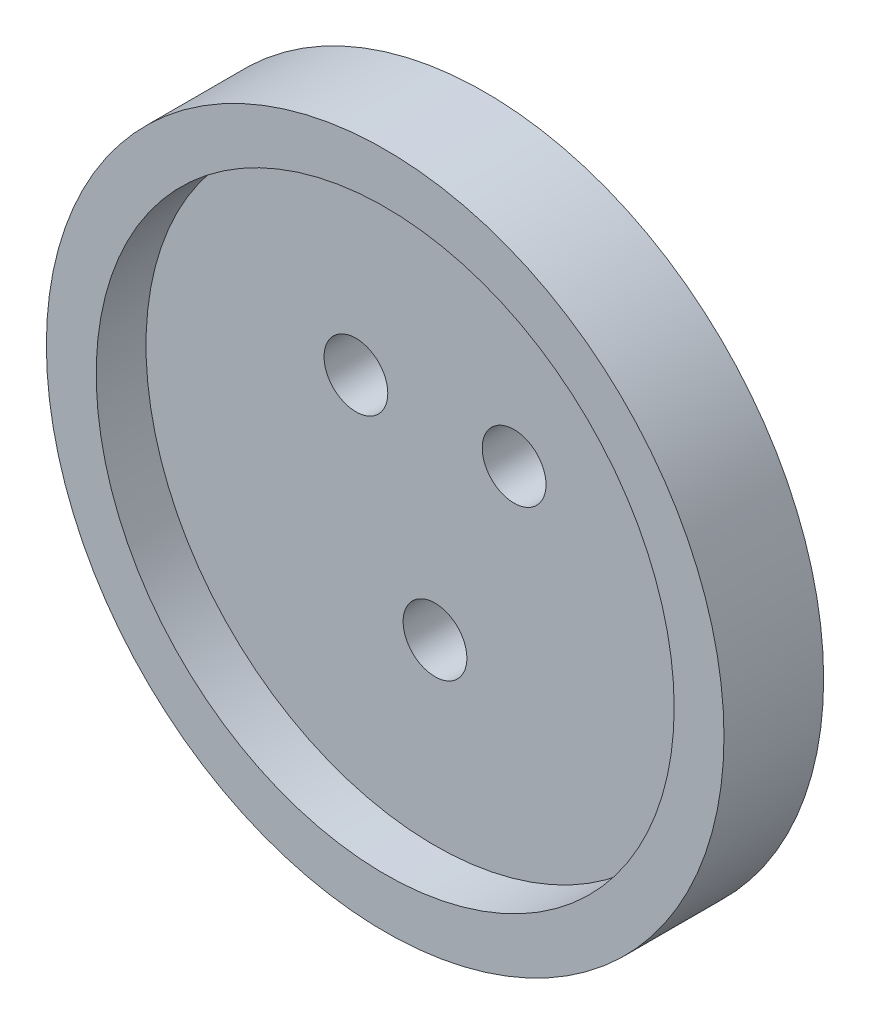
ISO-10303-21;
HEADER;
FILE_DESCRIPTION(('STEP AP214'),'2;1');
FILE_NAME('part.step','',(''),(''),'','','');
FILE_SCHEMA(('AUTOMOTIVE_DESIGN { 1 0 10303 214 1 1 1 1 }'));
ENDSEC;
DATA;
#1=APPLICATION_CONTEXT('core data for automotive mechanical design processes');
#2=APPLICATION_PROTOCOL_DEFINITION('international standard','automotive_design',2000,#1);
#3=PRODUCT_CONTEXT('',#1,'mechanical');
#4=PRODUCT('Part','Part','',(#3));
#5=PRODUCT_RELATED_PRODUCT_CATEGORY('part','',(#4));
#6=PRODUCT_DEFINITION_FORMATION('','',#4);
#7=PRODUCT_DEFINITION_CONTEXT('part definition',#1,'design');
#8=PRODUCT_DEFINITION('design','',#6,#7);
#9=PRODUCT_DEFINITION_SHAPE('','',#8);
#10=(LENGTH_UNIT() NAMED_UNIT(*) SI_UNIT(.MILLI.,.METRE.));
#11=(NAMED_UNIT(*) PLANE_ANGLE_UNIT() SI_UNIT($,.RADIAN.));
#12=(NAMED_UNIT(*) SI_UNIT($,.STERADIAN.) SOLID_ANGLE_UNIT());
#13=UNCERTAINTY_MEASURE_WITH_UNIT(LENGTH_MEASURE(1.E-05),#10,'distance_accuracy_value','');
#14=(GEOMETRIC_REPRESENTATION_CONTEXT(3) GLOBAL_UNCERTAINTY_ASSIGNED_CONTEXT((#13)) GLOBAL_UNIT_ASSIGNED_CONTEXT((#10,
#11,#12)) REPRESENTATION_CONTEXT('',''));
#15=CARTESIAN_POINT('',(0.,0.,0.));
#16=DIRECTION('',(0.,0.,1.));
#17=DIRECTION('',(1.,0.,0.));
#18=AXIS2_PLACEMENT_3D('',#15,#16,#17);
#19=CARTESIAN_POINT('',(0.,0.,0.));
#20=DIRECTION('',(0.,0.,1.));
#21=DIRECTION('',(1.,0.,0.));
#22=AXIS2_PLACEMENT_3D('',#19,#20,#21);
#23=PLANE('',#22);
#24=CARTESIAN_POINT('',(0.,-11.1125,0.));
#25=DIRECTION('',(0.,0.,1.));
#26=DIRECTION('',(1.,0.,0.));
#27=AXIS2_PLACEMENT_3D('',#24,#25,#26);
#28=CIRCLE('',#27,3.2);
#29=CARTESIAN_POINT('',(3.2,-11.1125,0.));
#30=VERTEX_POINT('',#29);
#31=EDGE_CURVE('E49',#30,#30,#28,.T.);
#32=ORIENTED_EDGE('',*,*,#31,.T.);
#33=EDGE_LOOP('',(#32));
#34=FACE_BOUND('',#33,.T.);
#35=CARTESIAN_POINT('',(7.9375,7.9375,0.));
#36=DIRECTION('',(0.,0.,1.));
#37=DIRECTION('',(1.,0.,0.));
#38=AXIS2_PLACEMENT_3D('',#35,#36,#37);
#39=CIRCLE('',#38,3.2);
#40=CARTESIAN_POINT('',(11.1375,7.9375,0.));
#41=VERTEX_POINT('',#40);
#42=EDGE_CURVE('E44',#41,#41,#39,.T.);
#43=ORIENTED_EDGE('',*,*,#42,.T.);
#44=EDGE_LOOP('',(#43));
#45=FACE_BOUND('',#44,.T.);
#46=CARTESIAN_POINT('',(-7.9375,7.9375,0.));
#47=DIRECTION('',(0.,0.,1.));
#48=DIRECTION('',(1.,0.,0.));
#49=AXIS2_PLACEMENT_3D('',#46,#47,#48);
#50=CIRCLE('',#49,3.2);
#51=CARTESIAN_POINT('',(-4.7375,7.9375,0.));
#52=VERTEX_POINT('',#51);
#53=EDGE_CURVE('E35',#52,#52,#50,.T.);
#54=ORIENTED_EDGE('',*,*,#53,.T.);
#55=EDGE_LOOP('',(#54));
#56=FACE_BOUND('',#55,.T.);
#57=CARTESIAN_POINT('',(0.,0.,0.));
#58=DIRECTION('',(0.,0.,-1.));
#59=DIRECTION('',(-1.,0.,0.));
#60=AXIS2_PLACEMENT_3D('',#57,#58,#59);
#61=CIRCLE('',#60,34.);
#62=CARTESIAN_POINT('',(-34.,0.,0.));
#63=VERTEX_POINT('',#62);
#64=EDGE_CURVE('E55',#63,#63,#61,.T.);
#65=ORIENTED_EDGE('',*,*,#64,.T.);
#66=EDGE_LOOP('',(#65));
#67=FACE_BOUND('',#66,.T.);
#68=ADVANCED_FACE('F29',(#34,#45,#56,#67),#23,.F.);
#69=CARTESIAN_POINT('',(0.,0.,5.));
#70=DIRECTION('',(0.,0.,1.));
#71=DIRECTION('',(1.,0.,0.));
#72=AXIS2_PLACEMENT_3D('',#69,#70,#71);
#73=PLANE('',#72);
#74=CARTESIAN_POINT('',(0.,0.,5.));
#75=DIRECTION('',(0.,0.,1.));
#76=DIRECTION('',(1.,0.,0.));
#77=AXIS2_PLACEMENT_3D('',#74,#75,#76);
#78=CIRCLE('',#77,29.);
#79=CARTESIAN_POINT('',(29.,0.,5.));
#80=VERTEX_POINT('',#79);
#81=EDGE_CURVE('E10',#80,#80,#78,.F.);
#82=ORIENTED_EDGE('',*,*,#81,.F.);
#83=EDGE_LOOP('',(#82));
#84=FACE_BOUND('',#83,.T.);
#85=CARTESIAN_POINT('',(0.,-11.1125,5.));
#86=DIRECTION('',(0.,0.,1.));
#87=DIRECTION('',(1.,0.,0.));
#88=AXIS2_PLACEMENT_3D('',#85,#86,#87);
#89=CIRCLE('',#88,3.2);
#90=CARTESIAN_POINT('',(3.2,-11.1125,5.));
#91=VERTEX_POINT('',#90);
#92=EDGE_CURVE('E52',#91,#91,#89,.T.);
#93=ORIENTED_EDGE('',*,*,#92,.F.);
#94=EDGE_LOOP('',(#93));
#95=FACE_BOUND('',#94,.T.);
#96=CARTESIAN_POINT('',(7.9375,7.9375,5.));
#97=DIRECTION('',(0.,0.,1.));
#98=DIRECTION('',(1.,0.,0.));
#99=AXIS2_PLACEMENT_3D('',#96,#97,#98);
#100=CIRCLE('',#99,3.2);
#101=CARTESIAN_POINT('',(11.1375,7.9375,5.));
#102=VERTEX_POINT('',#101);
#103=EDGE_CURVE('E46',#102,#102,#100,.T.);
#104=ORIENTED_EDGE('',*,*,#103,.F.);
#105=EDGE_LOOP('',(#104));
#106=FACE_BOUND('',#105,.T.);
#107=CARTESIAN_POINT('',(-7.9375,7.9375,5.));
#108=DIRECTION('',(0.,0.,1.));
#109=DIRECTION('',(1.,0.,0.));
#110=AXIS2_PLACEMENT_3D('',#107,#108,#109);
#111=CIRCLE('',#110,3.2);
#112=CARTESIAN_POINT('',(-4.7375,7.9375,5.));
#113=VERTEX_POINT('',#112);
#114=EDGE_CURVE('E39',#113,#113,#111,.T.);
#115=ORIENTED_EDGE('',*,*,#114,.F.);
#116=EDGE_LOOP('',(#115));
#117=FACE_BOUND('',#116,.T.);
#118=ADVANCED_FACE('F83',(#84,#95,#106,#117),#73,.T.);
#119=CARTESIAN_POINT('',(-7.9375,7.9375,0.));
#120=DIRECTION('',(0.,0.,1.));
#121=DIRECTION('',(1.,0.,0.));
#122=AXIS2_PLACEMENT_3D('',#119,#120,#121);
#123=CYLINDRICAL_SURFACE('',#122,3.2);
#124=ORIENTED_EDGE('',*,*,#53,.F.);
#125=EDGE_LOOP('',(#124));
#126=FACE_BOUND('',#125,.T.);
#127=ORIENTED_EDGE('',*,*,#114,.T.);
#128=EDGE_LOOP('',(#127));
#129=FACE_BOUND('',#128,.T.);
#130=ADVANCED_FACE('F88',(#126,#129),#123,.F.);
#131=CARTESIAN_POINT('',(7.9375,7.9375,0.));
#132=DIRECTION('',(0.,0.,1.));
#133=DIRECTION('',(1.,0.,0.));
#134=AXIS2_PLACEMENT_3D('',#131,#132,#133);
#135=CYLINDRICAL_SURFACE('',#134,3.2);
#136=ORIENTED_EDGE('',*,*,#42,.F.);
#137=EDGE_LOOP('',(#136));
#138=FACE_BOUND('',#137,.T.);
#139=ORIENTED_EDGE('',*,*,#103,.T.);
#140=EDGE_LOOP('',(#139));
#141=FACE_BOUND('',#140,.T.);
#142=ADVANCED_FACE('F98',(#138,#141),#135,.F.);
#143=CARTESIAN_POINT('',(0.,-11.1125,0.));
#144=DIRECTION('',(0.,0.,1.));
#145=DIRECTION('',(1.,0.,0.));
#146=AXIS2_PLACEMENT_3D('',#143,#144,#145);
#147=CYLINDRICAL_SURFACE('',#146,3.2);
#148=ORIENTED_EDGE('',*,*,#31,.F.);
#149=EDGE_LOOP('',(#148));
#150=FACE_BOUND('',#149,.T.);
#151=ORIENTED_EDGE('',*,*,#92,.T.);
#152=EDGE_LOOP('',(#151));
#153=FACE_BOUND('',#152,.T.);
#154=ADVANCED_FACE('F79',(#150,#153),#147,.F.);
#155=CARTESIAN_POINT('',(0.,0.,5.));
#156=DIRECTION('',(0.,0.,-1.));
#157=DIRECTION('',(-1.,0.,0.));
#158=AXIS2_PLACEMENT_3D('',#155,#156,#157);
#159=CYLINDRICAL_SURFACE('',#158,34.);
#160=ORIENTED_EDGE('',*,*,#64,.F.);
#161=EDGE_LOOP('',(#160));
#162=FACE_BOUND('',#161,.T.);
#163=CARTESIAN_POINT('',(0.,0.,10.));
#164=DIRECTION('',(0.,0.,1.));
#165=DIRECTION('',(1.,0.,0.));
#166=AXIS2_PLACEMENT_3D('',#163,#164,#165);
#167=CIRCLE('',#166,34.);
#168=CARTESIAN_POINT('',(34.,0.,10.));
#169=VERTEX_POINT('',#168);
#170=EDGE_CURVE('E60',#169,#169,#167,.T.);
#171=ORIENTED_EDGE('',*,*,#170,.F.);
#172=EDGE_LOOP('',(#171));
#173=FACE_BOUND('',#172,.T.);
#174=ADVANCED_FACE('F71',(#162,#173),#159,.T.);
#175=CARTESIAN_POINT('',(0.,0.,10.));
#176=DIRECTION('',(0.,0.,1.));
#177=DIRECTION('',(1.,0.,0.));
#178=AXIS2_PLACEMENT_3D('',#175,#176,#177);
#179=PLANE('',#178);
#180=ORIENTED_EDGE('',*,*,#170,.T.);
#181=EDGE_LOOP('',(#180));
#182=FACE_BOUND('',#181,.T.);
#183=CARTESIAN_POINT('',(0.,0.,10.));
#184=DIRECTION('',(0.,0.,1.));
#185=DIRECTION('',(1.,0.,0.));
#186=AXIS2_PLACEMENT_3D('',#183,#184,#185);
#187=CIRCLE('',#186,29.);
#188=CARTESIAN_POINT('',(29.,0.,10.));
#189=VERTEX_POINT('',#188);
#190=EDGE_CURVE('E63',#189,#189,#187,.T.);
#191=ORIENTED_EDGE('',*,*,#190,.F.);
#192=EDGE_LOOP('',(#191));
#193=FACE_BOUND('',#192,.T.);
#194=ADVANCED_FACE('F69',(#182,#193),#179,.T.);
#195=CARTESIAN_POINT('',(0.,0.,10.));
#196=DIRECTION('',(0.,0.,-1.));
#197=DIRECTION('',(-1.,0.,0.));
#198=AXIS2_PLACEMENT_3D('',#195,#196,#197);
#199=CYLINDRICAL_SURFACE('',#198,29.);
#200=ORIENTED_EDGE('',*,*,#190,.T.);
#201=EDGE_LOOP('',(#200));
#202=FACE_BOUND('',#201,.T.);
#203=ORIENTED_EDGE('',*,*,#81,.T.);
#204=EDGE_LOOP('',(#203));
#205=FACE_BOUND('',#204,.T.);
#206=ADVANCED_FACE('F67',(#202,#205),#199,.F.);
#207=CLOSED_SHELL('',(#68,#118,#130,#142,#154,#174,#194,#206));
#208=MANIFOLD_SOLID_BREP('B2',#207);
#209=ADVANCED_BREP_SHAPE_REPRESENTATION('',(#18,#208),#14);
#210=SHAPE_DEFINITION_REPRESENTATION(#9,#209);
ENDSEC;
END-ISO-10303-21;
